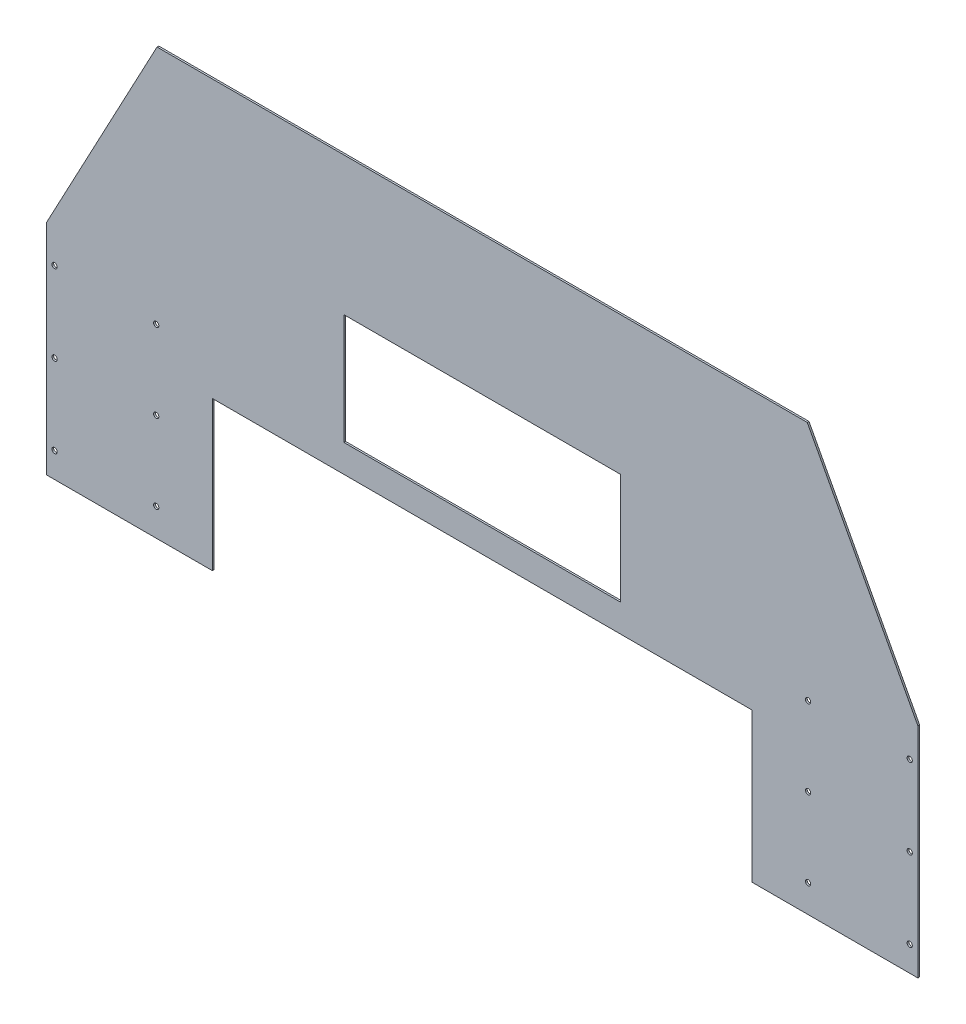
ISO-10303-21;
HEADER;
FILE_DESCRIPTION(('STEP AP214'),'2;1');
FILE_NAME('part.step','',(''),(''),'','','');
FILE_SCHEMA(('AUTOMOTIVE_DESIGN { 1 0 10303 214 1 1 1 1 }'));
ENDSEC;
DATA;
#1=APPLICATION_CONTEXT('core data for automotive mechanical design processes');
#2=APPLICATION_PROTOCOL_DEFINITION('international standard','automotive_design',2000,#1);
#3=PRODUCT_CONTEXT('',#1,'mechanical');
#4=PRODUCT('Part','Part','',(#3));
#5=PRODUCT_RELATED_PRODUCT_CATEGORY('part','',(#4));
#6=PRODUCT_DEFINITION_FORMATION('','',#4);
#7=PRODUCT_DEFINITION_CONTEXT('part definition',#1,'design');
#8=PRODUCT_DEFINITION('design','',#6,#7);
#9=PRODUCT_DEFINITION_SHAPE('','',#8);
#10=(LENGTH_UNIT() NAMED_UNIT(*) SI_UNIT(.MILLI.,.METRE.));
#11=(NAMED_UNIT(*) PLANE_ANGLE_UNIT() SI_UNIT($,.RADIAN.));
#12=(NAMED_UNIT(*) SI_UNIT($,.STERADIAN.) SOLID_ANGLE_UNIT());
#13=UNCERTAINTY_MEASURE_WITH_UNIT(LENGTH_MEASURE(1.E-05),#10,'distance_accuracy_value','');
#14=(GEOMETRIC_REPRESENTATION_CONTEXT(3) GLOBAL_UNCERTAINTY_ASSIGNED_CONTEXT((#13)) GLOBAL_UNIT_ASSIGNED_CONTEXT((#10,
#11,#12)) REPRESENTATION_CONTEXT('',''));
#15=CARTESIAN_POINT('',(0.,0.,0.));
#16=DIRECTION('',(0.,0.,1.));
#17=DIRECTION('',(1.,0.,0.));
#18=AXIS2_PLACEMENT_3D('',#15,#16,#17);
#19=CARTESIAN_POINT('',(-76.2,-100.203,-1.6002));
#20=DIRECTION('',(-1.,0.,0.));
#21=DIRECTION('',(0.,0.,1.));
#22=AXIS2_PLACEMENT_3D('',#19,#20,#21);
#23=PLANE('',#22);
#24=DIRECTION('',(0.,-1.,0.));
#25=VECTOR('',#24,1.);
#26=CARTESIAN_POINT('',(-76.2,-100.203,0.));
#27=LINE('',#26,#25);
#28=CARTESIAN_POINT('',(-76.2,100.203,0.));
#29=VERTEX_POINT('',#28);
#30=CARTESIAN_POINT('',(-76.2,-100.203,0.));
#31=VERTEX_POINT('',#30);
#32=EDGE_CURVE('E245',#29,#31,#27,.T.);
#33=ORIENTED_EDGE('',*,*,#32,.F.);
#34=DIRECTION('',(0.,0.,1.));
#35=VECTOR('',#34,1.);
#36=CARTESIAN_POINT('',(-76.2,100.203,-1.6002));
#37=LINE('',#36,#35);
#38=CARTESIAN_POINT('',(-76.2,100.203,-1.6002));
#39=VERTEX_POINT('',#38);
#40=EDGE_CURVE('E11',#39,#29,#37,.T.);
#41=ORIENTED_EDGE('',*,*,#40,.F.);
#42=DIRECTION('',(0.,-1.,0.));
#43=VECTOR('',#42,1.);
#44=CARTESIAN_POINT('',(-76.2,-100.203,-1.6002));
#45=LINE('',#44,#43);
#46=CARTESIAN_POINT('',(-76.2,-100.203,-1.6002));
#47=VERTEX_POINT('',#46);
#48=EDGE_CURVE('E248',#39,#47,#45,.T.);
#49=ORIENTED_EDGE('',*,*,#48,.T.);
#50=DIRECTION('',(0.,0.,1.));
#51=VECTOR('',#50,1.);
#52=CARTESIAN_POINT('',(-76.2,-100.203,-1.6002));
#53=LINE('',#52,#51);
#54=EDGE_CURVE('E41',#47,#31,#53,.T.);
#55=ORIENTED_EDGE('',*,*,#54,.T.);
#56=EDGE_LOOP('',(#33,#41,#49,#55));
#57=FACE_BOUND('',#56,.T.);
#58=ADVANCED_FACE('F38',(#57),#23,.T.);
#59=CARTESIAN_POINT('',(25.4000000000002,290.703,-1.6002));
#60=DIRECTION('',(-0.88235294117647,0.470588235294118,0.));
#61=DIRECTION('',(-0.470588235294118,-0.88235294117647,0.));
#62=AXIS2_PLACEMENT_3D('',#59,#60,#61);
#63=PLANE('',#62);
#64=DIRECTION('',(-0.470588235294118,-0.88235294117647,0.));
#65=VECTOR('',#64,1.);
#66=CARTESIAN_POINT('',(25.4000000000002,290.703,0.));
#67=LINE('',#66,#65);
#68=CARTESIAN_POINT('',(25.4000000000002,290.703,0.));
#69=VERTEX_POINT('',#68);
#70=EDGE_CURVE('E252',#69,#29,#67,.T.);
#71=ORIENTED_EDGE('',*,*,#70,.F.);
#72=DIRECTION('',(0.,0.,1.));
#73=VECTOR('',#72,1.);
#74=CARTESIAN_POINT('',(25.4000000000002,290.703,-1.6002));
#75=LINE('',#74,#73);
#76=CARTESIAN_POINT('',(25.4000000000002,290.703,-1.6002));
#77=VERTEX_POINT('',#76);
#78=EDGE_CURVE('E46',#77,#69,#75,.T.);
#79=ORIENTED_EDGE('',*,*,#78,.F.);
#80=DIRECTION('',(-0.470588235294118,-0.88235294117647,0.));
#81=VECTOR('',#80,1.);
#82=CARTESIAN_POINT('',(25.4000000000002,290.703,-1.6002));
#83=LINE('',#82,#81);
#84=EDGE_CURVE('E276',#77,#39,#83,.T.);
#85=ORIENTED_EDGE('',*,*,#84,.T.);
#86=ORIENTED_EDGE('',*,*,#40,.T.);
#87=EDGE_LOOP('',(#71,#79,#85,#86));
#88=FACE_BOUND('',#87,.T.);
#89=ADVANCED_FACE('F332',(#88),#63,.T.);
#90=CARTESIAN_POINT('',(622.3,290.703,-1.6002));
#91=DIRECTION('',(0.,1.,0.));
#92=DIRECTION('',(0.,0.,1.));
#93=AXIS2_PLACEMENT_3D('',#90,#91,#92);
#94=PLANE('',#93);
#95=DIRECTION('',(-1.,0.,0.));
#96=VECTOR('',#95,1.);
#97=CARTESIAN_POINT('',(622.3,290.703,0.));
#98=LINE('',#97,#96);
#99=CARTESIAN_POINT('',(622.3,290.703,0.));
#100=VERTEX_POINT('',#99);
#101=EDGE_CURVE('E302',#100,#69,#98,.T.);
#102=ORIENTED_EDGE('',*,*,#101,.F.);
#103=DIRECTION('',(0.,0.,1.));
#104=VECTOR('',#103,1.);
#105=CARTESIAN_POINT('',(622.3,290.703,-1.6002));
#106=LINE('',#105,#104);
#107=CARTESIAN_POINT('',(622.3,290.703,-1.6002));
#108=VERTEX_POINT('',#107);
#109=EDGE_CURVE('E308',#108,#100,#106,.T.);
#110=ORIENTED_EDGE('',*,*,#109,.F.);
#111=DIRECTION('',(-1.,0.,0.));
#112=VECTOR('',#111,1.);
#113=CARTESIAN_POINT('',(622.3,290.703,-1.6002));
#114=LINE('',#113,#112);
#115=EDGE_CURVE('E273',#108,#77,#114,.T.);
#116=ORIENTED_EDGE('',*,*,#115,.T.);
#117=ORIENTED_EDGE('',*,*,#78,.T.);
#118=EDGE_LOOP('',(#102,#110,#116,#117));
#119=FACE_BOUND('',#118,.T.);
#120=ADVANCED_FACE('F361',(#119),#94,.T.);
#121=CARTESIAN_POINT('',(723.9,100.203,-1.6002));
#122=DIRECTION('',(0.88235294117647,0.470588235294118,0.));
#123=DIRECTION('',(-0.470588235294118,0.88235294117647,0.));
#124=AXIS2_PLACEMENT_3D('',#121,#122,#123);
#125=PLANE('',#124);
#126=DIRECTION('',(-0.470588235294118,0.88235294117647,0.));
#127=VECTOR('',#126,1.);
#128=CARTESIAN_POINT('',(723.9,100.203,0.));
#129=LINE('',#128,#127);
#130=CARTESIAN_POINT('',(723.9,100.203,0.));
#131=VERTEX_POINT('',#130);
#132=EDGE_CURVE('E299',#131,#100,#129,.T.);
#133=ORIENTED_EDGE('',*,*,#132,.F.);
#134=DIRECTION('',(0.,0.,1.));
#135=VECTOR('',#134,1.);
#136=CARTESIAN_POINT('',(723.9,100.203,-1.6002));
#137=LINE('',#136,#135);
#138=CARTESIAN_POINT('',(723.9,100.203,-1.6002));
#139=VERTEX_POINT('',#138);
#140=EDGE_CURVE('E310',#139,#131,#137,.T.);
#141=ORIENTED_EDGE('',*,*,#140,.F.);
#142=DIRECTION('',(-0.470588235294118,0.88235294117647,0.));
#143=VECTOR('',#142,1.);
#144=CARTESIAN_POINT('',(723.9,100.203,-1.6002));
#145=LINE('',#144,#143);
#146=EDGE_CURVE('E270',#139,#108,#145,.T.);
#147=ORIENTED_EDGE('',*,*,#146,.T.);
#148=ORIENTED_EDGE('',*,*,#109,.T.);
#149=EDGE_LOOP('',(#133,#141,#147,#148));
#150=FACE_BOUND('',#149,.T.);
#151=ADVANCED_FACE('F359',(#150),#125,.T.);
#152=CARTESIAN_POINT('',(723.9,100.203,-1.6002));
#153=DIRECTION('',(1.,0.,0.));
#154=DIRECTION('',(0.,0.,-1.));
#155=AXIS2_PLACEMENT_3D('',#152,#153,#154);
#156=PLANE('',#155);
#157=DIRECTION('',(0.,1.,0.));
#158=VECTOR('',#157,1.);
#159=CARTESIAN_POINT('',(723.9,100.203,0.));
#160=LINE('',#159,#158);
#161=CARTESIAN_POINT('',(723.9,-100.203,0.));
#162=VERTEX_POINT('',#161);
#163=EDGE_CURVE('E296',#162,#131,#160,.T.);
#164=ORIENTED_EDGE('',*,*,#163,.F.);
#165=DIRECTION('',(0.,0.,1.));
#166=VECTOR('',#165,1.);
#167=CARTESIAN_POINT('',(723.9,-100.203,-1.6002));
#168=LINE('',#167,#166);
#169=CARTESIAN_POINT('',(723.9,-100.203,-1.6002));
#170=VERTEX_POINT('',#169);
#171=EDGE_CURVE('E312',#170,#162,#168,.T.);
#172=ORIENTED_EDGE('',*,*,#171,.F.);
#173=DIRECTION('',(0.,1.,0.));
#174=VECTOR('',#173,1.);
#175=CARTESIAN_POINT('',(723.9,100.203,-1.6002));
#176=LINE('',#175,#174);
#177=EDGE_CURVE('E267',#170,#139,#176,.T.);
#178=ORIENTED_EDGE('',*,*,#177,.T.);
#179=ORIENTED_EDGE('',*,*,#140,.T.);
#180=EDGE_LOOP('',(#164,#172,#178,#179));
#181=FACE_BOUND('',#180,.T.);
#182=ADVANCED_FACE('F355',(#181),#156,.T.);
#183=CARTESIAN_POINT('',(571.5,-100.203,-1.6002));
#184=DIRECTION('',(0.,-1.,0.));
#185=DIRECTION('',(0.,0.,-1.));
#186=AXIS2_PLACEMENT_3D('',#183,#184,#185);
#187=PLANE('',#186);
#188=DIRECTION('',(1.,0.,0.));
#189=VECTOR('',#188,1.);
#190=CARTESIAN_POINT('',(571.5,-100.203,0.));
#191=LINE('',#190,#189);
#192=CARTESIAN_POINT('',(571.5,-100.203,0.));
#193=VERTEX_POINT('',#192);
#194=EDGE_CURVE('E293',#193,#162,#191,.T.);
#195=ORIENTED_EDGE('',*,*,#194,.F.);
#196=DIRECTION('',(0.,0.,1.));
#197=VECTOR('',#196,1.);
#198=CARTESIAN_POINT('',(571.5,-100.203,-1.6002));
#199=LINE('',#198,#197);
#200=CARTESIAN_POINT('',(571.5,-100.203,-1.6002));
#201=VERTEX_POINT('',#200);
#202=EDGE_CURVE('E314',#201,#193,#199,.T.);
#203=ORIENTED_EDGE('',*,*,#202,.F.);
#204=DIRECTION('',(1.,0.,0.));
#205=VECTOR('',#204,1.);
#206=CARTESIAN_POINT('',(571.5,-100.203,-1.6002));
#207=LINE('',#206,#205);
#208=EDGE_CURVE('E264',#201,#170,#207,.T.);
#209=ORIENTED_EDGE('',*,*,#208,.T.);
#210=ORIENTED_EDGE('',*,*,#171,.T.);
#211=EDGE_LOOP('',(#195,#203,#209,#210));
#212=FACE_BOUND('',#211,.T.);
#213=ADVANCED_FACE('F351',(#212),#187,.T.);
#214=CARTESIAN_POINT('',(571.5,36.703,-1.6002));
#215=DIRECTION('',(-1.,0.,0.));
#216=DIRECTION('',(0.,0.,1.));
#217=AXIS2_PLACEMENT_3D('',#214,#215,#216);
#218=PLANE('',#217);
#219=DIRECTION('',(0.,-1.,0.));
#220=VECTOR('',#219,1.);
#221=CARTESIAN_POINT('',(571.5,36.703,0.));
#222=LINE('',#221,#220);
#223=CARTESIAN_POINT('',(571.5,36.703,0.));
#224=VERTEX_POINT('',#223);
#225=EDGE_CURVE('E290',#224,#193,#222,.T.);
#226=ORIENTED_EDGE('',*,*,#225,.F.);
#227=DIRECTION('',(0.,0.,1.));
#228=VECTOR('',#227,1.);
#229=CARTESIAN_POINT('',(571.5,36.703,-1.6002));
#230=LINE('',#229,#228);
#231=CARTESIAN_POINT('',(571.5,36.703,-1.6002));
#232=VERTEX_POINT('',#231);
#233=EDGE_CURVE('E316',#232,#224,#230,.T.);
#234=ORIENTED_EDGE('',*,*,#233,.F.);
#235=DIRECTION('',(0.,-1.,0.));
#236=VECTOR('',#235,1.);
#237=CARTESIAN_POINT('',(571.5,36.703,-1.6002));
#238=LINE('',#237,#236);
#239=EDGE_CURVE('E261',#232,#201,#238,.T.);
#240=ORIENTED_EDGE('',*,*,#239,.T.);
#241=ORIENTED_EDGE('',*,*,#202,.T.);
#242=EDGE_LOOP('',(#226,#234,#240,#241));
#243=FACE_BOUND('',#242,.T.);
#244=ADVANCED_FACE('F347',(#243),#218,.T.);
#245=CARTESIAN_POINT('',(76.2,36.703,-1.6002));
#246=DIRECTION('',(0.,-1.,0.));
#247=DIRECTION('',(0.,0.,-1.));
#248=AXIS2_PLACEMENT_3D('',#245,#246,#247);
#249=PLANE('',#248);
#250=DIRECTION('',(1.,0.,0.));
#251=VECTOR('',#250,1.);
#252=CARTESIAN_POINT('',(76.2,36.703,0.));
#253=LINE('',#252,#251);
#254=CARTESIAN_POINT('',(76.2,36.703,0.));
#255=VERTEX_POINT('',#254);
#256=EDGE_CURVE('E287',#255,#224,#253,.T.);
#257=ORIENTED_EDGE('',*,*,#256,.F.);
#258=DIRECTION('',(0.,0.,1.));
#259=VECTOR('',#258,1.);
#260=CARTESIAN_POINT('',(76.2,36.703,-1.6002));
#261=LINE('',#260,#259);
#262=CARTESIAN_POINT('',(76.2,36.703,-1.6002));
#263=VERTEX_POINT('',#262);
#264=EDGE_CURVE('E318',#263,#255,#261,.T.);
#265=ORIENTED_EDGE('',*,*,#264,.F.);
#266=DIRECTION('',(1.,0.,0.));
#267=VECTOR('',#266,1.);
#268=CARTESIAN_POINT('',(76.2,36.703,-1.6002));
#269=LINE('',#268,#267);
#270=EDGE_CURVE('E258',#263,#232,#269,.T.);
#271=ORIENTED_EDGE('',*,*,#270,.T.);
#272=ORIENTED_EDGE('',*,*,#233,.T.);
#273=EDGE_LOOP('',(#257,#265,#271,#272));
#274=FACE_BOUND('',#273,.T.);
#275=ADVANCED_FACE('F345',(#274),#249,.T.);
#276=CARTESIAN_POINT('',(76.2,-100.203,-1.6002));
#277=DIRECTION('',(1.,0.,0.));
#278=DIRECTION('',(0.,0.,-1.));
#279=AXIS2_PLACEMENT_3D('',#276,#277,#278);
#280=PLANE('',#279);
#281=DIRECTION('',(0.,1.,0.));
#282=VECTOR('',#281,1.);
#283=CARTESIAN_POINT('',(76.2,-100.203,0.));
#284=LINE('',#283,#282);
#285=CARTESIAN_POINT('',(76.2,-100.203,0.));
#286=VERTEX_POINT('',#285);
#287=EDGE_CURVE('E284',#286,#255,#284,.T.);
#288=ORIENTED_EDGE('',*,*,#287,.F.);
#289=DIRECTION('',(0.,0.,1.));
#290=VECTOR('',#289,1.);
#291=CARTESIAN_POINT('',(76.2,-100.203,-1.6002));
#292=LINE('',#291,#290);
#293=CARTESIAN_POINT('',(76.2,-100.203,-1.6002));
#294=VERTEX_POINT('',#293);
#295=EDGE_CURVE('E319',#294,#286,#292,.T.);
#296=ORIENTED_EDGE('',*,*,#295,.F.);
#297=DIRECTION('',(0.,1.,0.));
#298=VECTOR('',#297,1.);
#299=CARTESIAN_POINT('',(76.2,-100.203,-1.6002));
#300=LINE('',#299,#298);
#301=EDGE_CURVE('E255',#294,#263,#300,.T.);
#302=ORIENTED_EDGE('',*,*,#301,.T.);
#303=ORIENTED_EDGE('',*,*,#264,.T.);
#304=EDGE_LOOP('',(#288,#296,#302,#303));
#305=FACE_BOUND('',#304,.T.);
#306=ADVANCED_FACE('F341',(#305),#280,.T.);
#307=CARTESIAN_POINT('',(-76.2,-100.203,-1.6002));
#308=DIRECTION('',(0.,-1.,0.));
#309=DIRECTION('',(0.,0.,-1.));
#310=AXIS2_PLACEMENT_3D('',#307,#308,#309);
#311=PLANE('',#310);
#312=DIRECTION('',(1.,0.,0.));
#313=VECTOR('',#312,1.);
#314=CARTESIAN_POINT('',(-76.2,-100.203,0.));
#315=LINE('',#314,#313);
#316=EDGE_CURVE('E281',#31,#286,#315,.T.);
#317=ORIENTED_EDGE('',*,*,#316,.F.);
#318=ORIENTED_EDGE('',*,*,#54,.F.);
#319=DIRECTION('',(1.,0.,0.));
#320=VECTOR('',#319,1.);
#321=CARTESIAN_POINT('',(-76.2,-100.203,-1.6002));
#322=LINE('',#321,#320);
#323=EDGE_CURVE('E251',#47,#294,#322,.T.);
#324=ORIENTED_EDGE('',*,*,#323,.T.);
#325=ORIENTED_EDGE('',*,*,#295,.T.);
#326=EDGE_LOOP('',(#317,#318,#324,#325));
#327=FACE_BOUND('',#326,.T.);
#328=ADVANCED_FACE('F327',(#327),#311,.T.);
#329=CARTESIAN_POINT('',(0.,0.,-1.6002));
#330=DIRECTION('',(0.,0.,1.));
#331=DIRECTION('',(1.,0.,0.));
#332=AXIS2_PLACEMENT_3D('',#329,#330,#331);
#333=PLANE('',#332);
#334=DIRECTION('',(1.,0.,0.));
#335=VECTOR('',#334,1.);
#336=CARTESIAN_POINT('',(450.85,163.703,-1.6002));
#337=LINE('',#336,#335);
#338=CARTESIAN_POINT('',(196.85,163.703,-1.6002));
#339=VERTEX_POINT('',#338);
#340=CARTESIAN_POINT('',(450.85,163.703,-1.6002));
#341=VERTEX_POINT('',#340);
#342=EDGE_CURVE('E166',#339,#341,#337,.T.);
#343=ORIENTED_EDGE('',*,*,#342,.F.);
#344=DIRECTION('',(0.,1.,0.));
#345=VECTOR('',#344,1.);
#346=CARTESIAN_POINT('',(196.85,163.703,-1.6002));
#347=LINE('',#346,#345);
#348=CARTESIAN_POINT('',(196.85,62.103,-1.6002));
#349=VERTEX_POINT('',#348);
#350=EDGE_CURVE('E54',#349,#339,#347,.T.);
#351=ORIENTED_EDGE('',*,*,#350,.F.);
#352=DIRECTION('',(-1.,0.,0.));
#353=VECTOR('',#352,1.);
#354=CARTESIAN_POINT('',(450.85,62.103,-1.6002));
#355=LINE('',#354,#353);
#356=CARTESIAN_POINT('',(450.85,62.103,-1.6002));
#357=VERTEX_POINT('',#356);
#358=EDGE_CURVE('E157',#357,#349,#355,.T.);
#359=ORIENTED_EDGE('',*,*,#358,.F.);
#360=DIRECTION('',(0.,-1.,0.));
#361=VECTOR('',#360,1.);
#362=CARTESIAN_POINT('',(450.85,163.703,-1.6002));
#363=LINE('',#362,#361);
#364=EDGE_CURVE('E160',#341,#357,#363,.T.);
#365=ORIENTED_EDGE('',*,*,#364,.F.);
#366=EDGE_LOOP('',(#343,#351,#359,#365));
#367=FACE_BOUND('',#366,.T.);
#368=CARTESIAN_POINT('',(623.062000103998,-74.8029999999936,-1.6002));
#369=DIRECTION('',(0.,0.,-1.));
#370=DIRECTION('',(-1.,0.,0.));
#371=AXIS2_PLACEMENT_3D('',#368,#369,#370);
#372=CIRCLE('',#371,2.4129999999999);
#373=CARTESIAN_POINT('',(620.649000103998,-74.8029999999936,-1.6002));
#374=VERTEX_POINT('',#373);
#375=EDGE_CURVE('E176',#374,#374,#372,.T.);
#376=ORIENTED_EDGE('',*,*,#375,.F.);
#377=EDGE_LOOP('',(#376));
#378=FACE_BOUND('',#377,.T.);
#379=CARTESIAN_POINT('',(716.381599999996,-77.1397999999935,-1.6002));
#380=DIRECTION('',(0.,0.,-1.));
#381=DIRECTION('',(-1.,0.,0.));
#382=AXIS2_PLACEMENT_3D('',#379,#380,#381);
#383=CIRCLE('',#382,2.41299999999995);
#384=CARTESIAN_POINT('',(713.968599999995,-77.1397999999935,-1.6002));
#385=VERTEX_POINT('',#384);
#386=EDGE_CURVE('E182',#385,#385,#383,.T.);
#387=ORIENTED_EDGE('',*,*,#386,.F.);
#388=EDGE_LOOP('',(#387));
#389=FACE_BOUND('',#388,.T.);
#390=CARTESIAN_POINT('',(716.381599999995,-3.63219999999351,-1.6002));
#391=DIRECTION('',(0.,0.,-1.));
#392=DIRECTION('',(-1.,0.,0.));
#393=AXIS2_PLACEMENT_3D('',#390,#391,#392);
#394=CIRCLE('',#393,2.41299999999995);
#395=CARTESIAN_POINT('',(713.968599999995,-3.63219999999351,-1.6002));
#396=VERTEX_POINT('',#395);
#397=EDGE_CURVE('E188',#396,#396,#394,.T.);
#398=ORIENTED_EDGE('',*,*,#397,.F.);
#399=EDGE_LOOP('',(#398));
#400=FACE_BOUND('',#399,.T.);
#401=CARTESIAN_POINT('',(623.062000103998,-2.46379999999358,-1.6002));
#402=DIRECTION('',(0.,0.,-1.));
#403=DIRECTION('',(-1.,0.,0.));
#404=AXIS2_PLACEMENT_3D('',#401,#402,#403);
#405=CIRCLE('',#404,2.41299999999991);
#406=CARTESIAN_POINT('',(620.649000103998,-2.46379999999358,-1.6002));
#407=VERTEX_POINT('',#406);
#408=EDGE_CURVE('E194',#407,#407,#405,.T.);
#409=ORIENTED_EDGE('',*,*,#408,.F.);
#410=EDGE_LOOP('',(#409));
#411=FACE_BOUND('',#410,.T.);
#412=CARTESIAN_POINT('',(716.381599999995,69.8754000000065,-1.6002));
#413=DIRECTION('',(0.,0.,-1.));
#414=DIRECTION('',(-1.,0.,0.));
#415=AXIS2_PLACEMENT_3D('',#412,#413,#414);
#416=CIRCLE('',#415,2.41299999999995);
#417=CARTESIAN_POINT('',(713.968599999995,69.8754000000065,-1.6002));
#418=VERTEX_POINT('',#417);
#419=EDGE_CURVE('E200',#418,#418,#416,.T.);
#420=ORIENTED_EDGE('',*,*,#419,.F.);
#421=EDGE_LOOP('',(#420));
#422=FACE_BOUND('',#421,.T.);
#423=CARTESIAN_POINT('',(623.062000103998,69.8754000000064,-1.6002));
#424=DIRECTION('',(0.,0.,-1.));
#425=DIRECTION('',(-1.,0.,0.));
#426=AXIS2_PLACEMENT_3D('',#423,#424,#425);
#427=CIRCLE('',#426,2.41299999999991);
#428=CARTESIAN_POINT('',(620.649000103998,69.8754000000064,-1.6002));
#429=VERTEX_POINT('',#428);
#430=EDGE_CURVE('E206',#429,#429,#427,.T.);
#431=ORIENTED_EDGE('',*,*,#430,.F.);
#432=EDGE_LOOP('',(#431));
#433=FACE_BOUND('',#432,.T.);
#434=CARTESIAN_POINT('',(24.6379998960024,-74.8029999999936,-1.6002));
#435=DIRECTION('',(0.,0.,1.));
#436=DIRECTION('',(1.,0.,0.));
#437=AXIS2_PLACEMENT_3D('',#434,#435,#436);
#438=CIRCLE('',#437,2.4129999999999);
#439=CARTESIAN_POINT('',(27.0509998960023,-74.8029999999936,-1.6002));
#440=VERTEX_POINT('',#439);
#441=EDGE_CURVE('E212',#440,#440,#438,.T.);
#442=ORIENTED_EDGE('',*,*,#441,.T.);
#443=EDGE_LOOP('',(#442));
#444=FACE_BOUND('',#443,.T.);
#445=CARTESIAN_POINT('',(-68.6815999999955,-77.1397999999935,-1.6002));
#446=DIRECTION('',(0.,0.,1.));
#447=DIRECTION('',(1.,0.,0.));
#448=AXIS2_PLACEMENT_3D('',#445,#446,#447);
#449=CIRCLE('',#448,2.41299999999995);
#450=CARTESIAN_POINT('',(-66.2685999999955,-77.1397999999935,-1.6002));
#451=VERTEX_POINT('',#450);
#452=EDGE_CURVE('E218',#451,#451,#449,.T.);
#453=ORIENTED_EDGE('',*,*,#452,.T.);
#454=EDGE_LOOP('',(#453));
#455=FACE_BOUND('',#454,.T.);
#456=CARTESIAN_POINT('',(-68.6815999999952,-3.63219999999351,-1.6002));
#457=DIRECTION('',(0.,0.,1.));
#458=DIRECTION('',(1.,0.,0.));
#459=AXIS2_PLACEMENT_3D('',#456,#457,#458);
#460=CIRCLE('',#459,2.41299999999995);
#461=CARTESIAN_POINT('',(-66.2685999999952,-3.63219999999351,-1.6002));
#462=VERTEX_POINT('',#461);
#463=EDGE_CURVE('E224',#462,#462,#460,.T.);
#464=ORIENTED_EDGE('',*,*,#463,.T.);
#465=EDGE_LOOP('',(#464));
#466=FACE_BOUND('',#465,.T.);
#467=CARTESIAN_POINT('',(24.6379998960021,-2.46379999999358,-1.6002));
#468=DIRECTION('',(0.,0.,1.));
#469=DIRECTION('',(1.,0.,0.));
#470=AXIS2_PLACEMENT_3D('',#467,#468,#469);
#471=CIRCLE('',#470,2.41299999999991);
#472=CARTESIAN_POINT('',(27.050999896002,-2.46379999999358,-1.6002));
#473=VERTEX_POINT('',#472);
#474=EDGE_CURVE('E230',#473,#473,#471,.T.);
#475=ORIENTED_EDGE('',*,*,#474,.T.);
#476=EDGE_LOOP('',(#475));
#477=FACE_BOUND('',#476,.T.);
#478=CARTESIAN_POINT('',(-68.6815999999949,69.8754000000065,-1.6002));
#479=DIRECTION('',(0.,0.,1.));
#480=DIRECTION('',(1.,0.,0.));
#481=AXIS2_PLACEMENT_3D('',#478,#479,#480);
#482=CIRCLE('',#481,2.41299999999995);
#483=CARTESIAN_POINT('',(-66.268599999995,69.8754000000065,-1.6002));
#484=VERTEX_POINT('',#483);
#485=EDGE_CURVE('E236',#484,#484,#482,.T.);
#486=ORIENTED_EDGE('',*,*,#485,.T.);
#487=EDGE_LOOP('',(#486));
#488=FACE_BOUND('',#487,.T.);
#489=CARTESIAN_POINT('',(24.6379998960018,69.8754000000064,-1.6002));
#490=DIRECTION('',(0.,0.,1.));
#491=DIRECTION('',(1.,0.,0.));
#492=AXIS2_PLACEMENT_3D('',#489,#490,#491);
#493=CIRCLE('',#492,2.41299999999991);
#494=CARTESIAN_POINT('',(27.0509998960017,69.8754000000064,-1.6002));
#495=VERTEX_POINT('',#494);
#496=EDGE_CURVE('E242',#495,#495,#493,.T.);
#497=ORIENTED_EDGE('',*,*,#496,.T.);
#498=EDGE_LOOP('',(#497));
#499=FACE_BOUND('',#498,.T.);
#500=ORIENTED_EDGE('',*,*,#48,.F.);
#501=ORIENTED_EDGE('',*,*,#84,.F.);
#502=ORIENTED_EDGE('',*,*,#115,.F.);
#503=ORIENTED_EDGE('',*,*,#146,.F.);
#504=ORIENTED_EDGE('',*,*,#177,.F.);
#505=ORIENTED_EDGE('',*,*,#208,.F.);
#506=ORIENTED_EDGE('',*,*,#239,.F.);
#507=ORIENTED_EDGE('',*,*,#270,.F.);
#508=ORIENTED_EDGE('',*,*,#301,.F.);
#509=ORIENTED_EDGE('',*,*,#323,.F.);
#510=EDGE_LOOP('',(#500,#501,#502,#503,#504,#505,#506,#507,#508,#509));
#511=FACE_BOUND('',#510,.T.);
#512=ADVANCED_FACE('F335',(#367,#378,#389,#400,#411,#422,#433,#444,#455,#466,#477,#488,#499,
#511),#333,.F.);
#513=CARTESIAN_POINT('',(0.,0.,0.));
#514=DIRECTION('',(0.,0.,1.));
#515=DIRECTION('',(1.,0.,0.));
#516=AXIS2_PLACEMENT_3D('',#513,#514,#515);
#517=PLANE('',#516);
#518=DIRECTION('',(0.,1.,0.));
#519=VECTOR('',#518,1.);
#520=CARTESIAN_POINT('',(196.85,163.703,0.));
#521=LINE('',#520,#519);
#522=CARTESIAN_POINT('',(196.85,62.103,0.));
#523=VERTEX_POINT('',#522);
#524=CARTESIAN_POINT('',(196.85,163.703,0.));
#525=VERTEX_POINT('',#524);
#526=EDGE_CURVE('E141',#523,#525,#521,.T.);
#527=ORIENTED_EDGE('',*,*,#526,.T.);
#528=DIRECTION('',(1.,0.,0.));
#529=VECTOR('',#528,1.);
#530=CARTESIAN_POINT('',(450.85,163.703,0.));
#531=LINE('',#530,#529);
#532=CARTESIAN_POINT('',(450.85,163.703,0.));
#533=VERTEX_POINT('',#532);
#534=EDGE_CURVE('E150',#525,#533,#531,.T.);
#535=ORIENTED_EDGE('',*,*,#534,.T.);
#536=DIRECTION('',(0.,-1.,0.));
#537=VECTOR('',#536,1.);
#538=CARTESIAN_POINT('',(450.85,163.703,0.));
#539=LINE('',#538,#537);
#540=CARTESIAN_POINT('',(450.85,62.103,0.));
#541=VERTEX_POINT('',#540);
#542=EDGE_CURVE('E62',#533,#541,#539,.T.);
#543=ORIENTED_EDGE('',*,*,#542,.T.);
#544=DIRECTION('',(-1.,0.,0.));
#545=VECTOR('',#544,1.);
#546=CARTESIAN_POINT('',(450.85,62.103,0.));
#547=LINE('',#546,#545);
#548=EDGE_CURVE('E147',#541,#523,#547,.T.);
#549=ORIENTED_EDGE('',*,*,#548,.T.);
#550=EDGE_LOOP('',(#527,#535,#543,#549));
#551=FACE_BOUND('',#550,.T.);
#552=CARTESIAN_POINT('',(623.062000103998,-74.8029999999936,0.));
#553=DIRECTION('',(0.,0.,-1.));
#554=DIRECTION('',(-1.,0.,0.));
#555=AXIS2_PLACEMENT_3D('',#552,#553,#554);
#556=CIRCLE('',#555,2.4129999999999);
#557=CARTESIAN_POINT('',(620.649000103998,-74.8029999999936,0.));
#558=VERTEX_POINT('',#557);
#559=EDGE_CURVE('E172',#558,#558,#556,.T.);
#560=ORIENTED_EDGE('',*,*,#559,.T.);
#561=EDGE_LOOP('',(#560));
#562=FACE_BOUND('',#561,.T.);
#563=CARTESIAN_POINT('',(716.381599999996,-77.1397999999935,0.));
#564=DIRECTION('',(0.,0.,-1.));
#565=DIRECTION('',(-1.,0.,0.));
#566=AXIS2_PLACEMENT_3D('',#563,#564,#565);
#567=CIRCLE('',#566,2.41299999999995);
#568=CARTESIAN_POINT('',(713.968599999995,-77.1397999999935,0.));
#569=VERTEX_POINT('',#568);
#570=EDGE_CURVE('E179',#569,#569,#567,.T.);
#571=ORIENTED_EDGE('',*,*,#570,.T.);
#572=EDGE_LOOP('',(#571));
#573=FACE_BOUND('',#572,.T.);
#574=CARTESIAN_POINT('',(716.381599999995,-3.63219999999351,0.));
#575=DIRECTION('',(0.,0.,-1.));
#576=DIRECTION('',(-1.,0.,0.));
#577=AXIS2_PLACEMENT_3D('',#574,#575,#576);
#578=CIRCLE('',#577,2.41299999999995);
#579=CARTESIAN_POINT('',(713.968599999995,-3.63219999999351,0.));
#580=VERTEX_POINT('',#579);
#581=EDGE_CURVE('E185',#580,#580,#578,.T.);
#582=ORIENTED_EDGE('',*,*,#581,.T.);
#583=EDGE_LOOP('',(#582));
#584=FACE_BOUND('',#583,.T.);
#585=CARTESIAN_POINT('',(623.062000103998,-2.46379999999358,0.));
#586=DIRECTION('',(0.,0.,-1.));
#587=DIRECTION('',(-1.,0.,0.));
#588=AXIS2_PLACEMENT_3D('',#585,#586,#587);
#589=CIRCLE('',#588,2.41299999999991);
#590=CARTESIAN_POINT('',(620.649000103998,-2.46379999999358,0.));
#591=VERTEX_POINT('',#590);
#592=EDGE_CURVE('E191',#591,#591,#589,.T.);
#593=ORIENTED_EDGE('',*,*,#592,.T.);
#594=EDGE_LOOP('',(#593));
#595=FACE_BOUND('',#594,.T.);
#596=CARTESIAN_POINT('',(716.381599999995,69.8754000000065,0.));
#597=DIRECTION('',(0.,0.,-1.));
#598=DIRECTION('',(-1.,0.,0.));
#599=AXIS2_PLACEMENT_3D('',#596,#597,#598);
#600=CIRCLE('',#599,2.41299999999995);
#601=CARTESIAN_POINT('',(713.968599999995,69.8754000000065,0.));
#602=VERTEX_POINT('',#601);
#603=EDGE_CURVE('E197',#602,#602,#600,.T.);
#604=ORIENTED_EDGE('',*,*,#603,.T.);
#605=EDGE_LOOP('',(#604));
#606=FACE_BOUND('',#605,.T.);
#607=CARTESIAN_POINT('',(623.062000103998,69.8754000000064,0.));
#608=DIRECTION('',(0.,0.,-1.));
#609=DIRECTION('',(-1.,0.,0.));
#610=AXIS2_PLACEMENT_3D('',#607,#608,#609);
#611=CIRCLE('',#610,2.41299999999991);
#612=CARTESIAN_POINT('',(620.649000103998,69.8754000000064,0.));
#613=VERTEX_POINT('',#612);
#614=EDGE_CURVE('E203',#613,#613,#611,.T.);
#615=ORIENTED_EDGE('',*,*,#614,.T.);
#616=EDGE_LOOP('',(#615));
#617=FACE_BOUND('',#616,.T.);
#618=CARTESIAN_POINT('',(24.6379998960024,-74.8029999999936,0.));
#619=DIRECTION('',(0.,0.,1.));
#620=DIRECTION('',(1.,0.,0.));
#621=AXIS2_PLACEMENT_3D('',#618,#619,#620);
#622=CIRCLE('',#621,2.4129999999999);
#623=CARTESIAN_POINT('',(27.0509998960023,-74.8029999999936,0.));
#624=VERTEX_POINT('',#623);
#625=EDGE_CURVE('E209',#624,#624,#622,.T.);
#626=ORIENTED_EDGE('',*,*,#625,.F.);
#627=EDGE_LOOP('',(#626));
#628=FACE_BOUND('',#627,.T.);
#629=CARTESIAN_POINT('',(-68.6815999999955,-77.1397999999935,0.));
#630=DIRECTION('',(0.,0.,1.));
#631=DIRECTION('',(1.,0.,0.));
#632=AXIS2_PLACEMENT_3D('',#629,#630,#631);
#633=CIRCLE('',#632,2.41299999999995);
#634=CARTESIAN_POINT('',(-66.2685999999955,-77.1397999999935,0.));
#635=VERTEX_POINT('',#634);
#636=EDGE_CURVE('E215',#635,#635,#633,.T.);
#637=ORIENTED_EDGE('',*,*,#636,.F.);
#638=EDGE_LOOP('',(#637));
#639=FACE_BOUND('',#638,.T.);
#640=CARTESIAN_POINT('',(-68.6815999999952,-3.63219999999351,0.));
#641=DIRECTION('',(0.,0.,1.));
#642=DIRECTION('',(1.,0.,0.));
#643=AXIS2_PLACEMENT_3D('',#640,#641,#642);
#644=CIRCLE('',#643,2.41299999999995);
#645=CARTESIAN_POINT('',(-66.2685999999952,-3.63219999999351,0.));
#646=VERTEX_POINT('',#645);
#647=EDGE_CURVE('E221',#646,#646,#644,.T.);
#648=ORIENTED_EDGE('',*,*,#647,.F.);
#649=EDGE_LOOP('',(#648));
#650=FACE_BOUND('',#649,.T.);
#651=CARTESIAN_POINT('',(24.6379998960021,-2.46379999999358,0.));
#652=DIRECTION('',(0.,0.,1.));
#653=DIRECTION('',(1.,0.,0.));
#654=AXIS2_PLACEMENT_3D('',#651,#652,#653);
#655=CIRCLE('',#654,2.41299999999991);
#656=CARTESIAN_POINT('',(27.050999896002,-2.46379999999358,0.));
#657=VERTEX_POINT('',#656);
#658=EDGE_CURVE('E227',#657,#657,#655,.T.);
#659=ORIENTED_EDGE('',*,*,#658,.F.);
#660=EDGE_LOOP('',(#659));
#661=FACE_BOUND('',#660,.T.);
#662=CARTESIAN_POINT('',(-68.6815999999949,69.8754000000065,0.));
#663=DIRECTION('',(0.,0.,1.));
#664=DIRECTION('',(1.,0.,0.));
#665=AXIS2_PLACEMENT_3D('',#662,#663,#664);
#666=CIRCLE('',#665,2.41299999999995);
#667=CARTESIAN_POINT('',(-66.268599999995,69.8754000000065,0.));
#668=VERTEX_POINT('',#667);
#669=EDGE_CURVE('E233',#668,#668,#666,.T.);
#670=ORIENTED_EDGE('',*,*,#669,.F.);
#671=EDGE_LOOP('',(#670));
#672=FACE_BOUND('',#671,.T.);
#673=CARTESIAN_POINT('',(24.6379998960018,69.8754000000064,0.));
#674=DIRECTION('',(0.,0.,1.));
#675=DIRECTION('',(1.,0.,0.));
#676=AXIS2_PLACEMENT_3D('',#673,#674,#675);
#677=CIRCLE('',#676,2.41299999999991);
#678=CARTESIAN_POINT('',(27.0509998960017,69.8754000000064,0.));
#679=VERTEX_POINT('',#678);
#680=EDGE_CURVE('E239',#679,#679,#677,.T.);
#681=ORIENTED_EDGE('',*,*,#680,.F.);
#682=EDGE_LOOP('',(#681));
#683=FACE_BOUND('',#682,.T.);
#684=ORIENTED_EDGE('',*,*,#32,.T.);
#685=ORIENTED_EDGE('',*,*,#316,.T.);
#686=ORIENTED_EDGE('',*,*,#287,.T.);
#687=ORIENTED_EDGE('',*,*,#256,.T.);
#688=ORIENTED_EDGE('',*,*,#225,.T.);
#689=ORIENTED_EDGE('',*,*,#194,.T.);
#690=ORIENTED_EDGE('',*,*,#163,.T.);
#691=ORIENTED_EDGE('',*,*,#132,.T.);
#692=ORIENTED_EDGE('',*,*,#101,.T.);
#693=ORIENTED_EDGE('',*,*,#70,.T.);
#694=EDGE_LOOP('',(#684,#685,#686,#687,#688,#689,#690,#691,#692,#693));
#695=FACE_BOUND('',#694,.T.);
#696=ADVANCED_FACE('F154',(#551,#562,#573,#584,#595,#606,#617,#628,#639,#650,#661,#672,#683,
#695),#517,.T.);
#697=CARTESIAN_POINT('',(24.6379998960018,69.8754000000064,-1.6002));
#698=DIRECTION('',(0.,0.,1.));
#699=DIRECTION('',(1.,0.,0.));
#700=AXIS2_PLACEMENT_3D('',#697,#698,#699);
#701=CYLINDRICAL_SURFACE('',#700,2.41299999999991);
#702=ORIENTED_EDGE('',*,*,#496,.F.);
#703=EDGE_LOOP('',(#702));
#704=FACE_BOUND('',#703,.T.);
#705=ORIENTED_EDGE('',*,*,#680,.T.);
#706=EDGE_LOOP('',(#705));
#707=FACE_BOUND('',#706,.T.);
#708=ADVANCED_FACE('F450',(#704,#707),#701,.F.);
#709=CARTESIAN_POINT('',(-68.6815999999949,69.8754000000065,-1.6002));
#710=DIRECTION('',(0.,0.,1.));
#711=DIRECTION('',(1.,0.,0.));
#712=AXIS2_PLACEMENT_3D('',#709,#710,#711);
#713=CYLINDRICAL_SURFACE('',#712,2.41299999999995);
#714=ORIENTED_EDGE('',*,*,#485,.F.);
#715=EDGE_LOOP('',(#714));
#716=FACE_BOUND('',#715,.T.);
#717=ORIENTED_EDGE('',*,*,#669,.T.);
#718=EDGE_LOOP('',(#717));
#719=FACE_BOUND('',#718,.T.);
#720=ADVANCED_FACE('F455',(#716,#719),#713,.F.);
#721=CARTESIAN_POINT('',(24.6379998960021,-2.46379999999358,-1.6002));
#722=DIRECTION('',(0.,0.,1.));
#723=DIRECTION('',(1.,0.,0.));
#724=AXIS2_PLACEMENT_3D('',#721,#722,#723);
#725=CYLINDRICAL_SURFACE('',#724,2.41299999999991);
#726=ORIENTED_EDGE('',*,*,#474,.F.);
#727=EDGE_LOOP('',(#726));
#728=FACE_BOUND('',#727,.T.);
#729=ORIENTED_EDGE('',*,*,#658,.T.);
#730=EDGE_LOOP('',(#729));
#731=FACE_BOUND('',#730,.T.);
#732=ADVANCED_FACE('F468',(#728,#731),#725,.F.);
#733=CARTESIAN_POINT('',(-68.6815999999952,-3.63219999999351,-1.6002));
#734=DIRECTION('',(0.,0.,1.));
#735=DIRECTION('',(1.,0.,0.));
#736=AXIS2_PLACEMENT_3D('',#733,#734,#735);
#737=CYLINDRICAL_SURFACE('',#736,2.41299999999995);
#738=ORIENTED_EDGE('',*,*,#463,.F.);
#739=EDGE_LOOP('',(#738));
#740=FACE_BOUND('',#739,.T.);
#741=ORIENTED_EDGE('',*,*,#647,.T.);
#742=EDGE_LOOP('',(#741));
#743=FACE_BOUND('',#742,.T.);
#744=ADVANCED_FACE('F479',(#740,#743),#737,.F.);
#745=CARTESIAN_POINT('',(-68.6815999999955,-77.1397999999935,-1.6002));
#746=DIRECTION('',(0.,0.,1.));
#747=DIRECTION('',(1.,0.,0.));
#748=AXIS2_PLACEMENT_3D('',#745,#746,#747);
#749=CYLINDRICAL_SURFACE('',#748,2.41299999999995);
#750=ORIENTED_EDGE('',*,*,#452,.F.);
#751=EDGE_LOOP('',(#750));
#752=FACE_BOUND('',#751,.T.);
#753=ORIENTED_EDGE('',*,*,#636,.T.);
#754=EDGE_LOOP('',(#753));
#755=FACE_BOUND('',#754,.T.);
#756=ADVANCED_FACE('F490',(#752,#755),#749,.F.);
#757=CARTESIAN_POINT('',(24.6379998960024,-74.8029999999936,-1.6002));
#758=DIRECTION('',(0.,0.,1.));
#759=DIRECTION('',(1.,0.,0.));
#760=AXIS2_PLACEMENT_3D('',#757,#758,#759);
#761=CYLINDRICAL_SURFACE('',#760,2.4129999999999);
#762=ORIENTED_EDGE('',*,*,#441,.F.);
#763=EDGE_LOOP('',(#762));
#764=FACE_BOUND('',#763,.T.);
#765=ORIENTED_EDGE('',*,*,#625,.T.);
#766=EDGE_LOOP('',(#765));
#767=FACE_BOUND('',#766,.T.);
#768=ADVANCED_FACE('F501',(#764,#767),#761,.F.);
#769=CARTESIAN_POINT('',(623.062000103998,69.8754000000064,-1.6002));
#770=DIRECTION('',(0.,0.,1.));
#771=DIRECTION('',(1.,0.,0.));
#772=AXIS2_PLACEMENT_3D('',#769,#770,#771);
#773=CYLINDRICAL_SURFACE('',#772,2.41299999999991);
#774=ORIENTED_EDGE('',*,*,#430,.T.);
#775=EDGE_LOOP('',(#774));
#776=FACE_BOUND('',#775,.T.);
#777=ORIENTED_EDGE('',*,*,#614,.F.);
#778=EDGE_LOOP('',(#777));
#779=FACE_BOUND('',#778,.T.);
#780=ADVANCED_FACE('F512',(#776,#779),#773,.F.);
#781=CARTESIAN_POINT('',(716.381599999995,69.8754000000065,-1.6002));
#782=DIRECTION('',(0.,0.,1.));
#783=DIRECTION('',(1.,0.,0.));
#784=AXIS2_PLACEMENT_3D('',#781,#782,#783);
#785=CYLINDRICAL_SURFACE('',#784,2.41299999999995);
#786=ORIENTED_EDGE('',*,*,#419,.T.);
#787=EDGE_LOOP('',(#786));
#788=FACE_BOUND('',#787,.T.);
#789=ORIENTED_EDGE('',*,*,#603,.F.);
#790=EDGE_LOOP('',(#789));
#791=FACE_BOUND('',#790,.T.);
#792=ADVANCED_FACE('F523',(#788,#791),#785,.F.);
#793=CARTESIAN_POINT('',(623.062000103998,-2.46379999999358,-1.6002));
#794=DIRECTION('',(0.,0.,1.));
#795=DIRECTION('',(1.,0.,0.));
#796=AXIS2_PLACEMENT_3D('',#793,#794,#795);
#797=CYLINDRICAL_SURFACE('',#796,2.41299999999991);
#798=ORIENTED_EDGE('',*,*,#408,.T.);
#799=EDGE_LOOP('',(#798));
#800=FACE_BOUND('',#799,.T.);
#801=ORIENTED_EDGE('',*,*,#592,.F.);
#802=EDGE_LOOP('',(#801));
#803=FACE_BOUND('',#802,.T.);
#804=ADVANCED_FACE('F534',(#800,#803),#797,.F.);
#805=CARTESIAN_POINT('',(716.381599999995,-3.63219999999351,-1.6002));
#806=DIRECTION('',(0.,0.,1.));
#807=DIRECTION('',(1.,0.,0.));
#808=AXIS2_PLACEMENT_3D('',#805,#806,#807);
#809=CYLINDRICAL_SURFACE('',#808,2.41299999999995);
#810=ORIENTED_EDGE('',*,*,#397,.T.);
#811=EDGE_LOOP('',(#810));
#812=FACE_BOUND('',#811,.T.);
#813=ORIENTED_EDGE('',*,*,#581,.F.);
#814=EDGE_LOOP('',(#813));
#815=FACE_BOUND('',#814,.T.);
#816=ADVANCED_FACE('F545',(#812,#815),#809,.F.);
#817=CARTESIAN_POINT('',(716.381599999996,-77.1397999999935,-1.6002));
#818=DIRECTION('',(0.,0.,1.));
#819=DIRECTION('',(1.,0.,0.));
#820=AXIS2_PLACEMENT_3D('',#817,#818,#819);
#821=CYLINDRICAL_SURFACE('',#820,2.41299999999995);
#822=ORIENTED_EDGE('',*,*,#386,.T.);
#823=EDGE_LOOP('',(#822));
#824=FACE_BOUND('',#823,.T.);
#825=ORIENTED_EDGE('',*,*,#570,.F.);
#826=EDGE_LOOP('',(#825));
#827=FACE_BOUND('',#826,.T.);
#828=ADVANCED_FACE('F556',(#824,#827),#821,.F.);
#829=CARTESIAN_POINT('',(623.062000103998,-74.8029999999936,-1.6002));
#830=DIRECTION('',(0.,0.,1.));
#831=DIRECTION('',(1.,0.,0.));
#832=AXIS2_PLACEMENT_3D('',#829,#830,#831);
#833=CYLINDRICAL_SURFACE('',#832,2.4129999999999);
#834=ORIENTED_EDGE('',*,*,#375,.T.);
#835=EDGE_LOOP('',(#834));
#836=FACE_BOUND('',#835,.T.);
#837=ORIENTED_EDGE('',*,*,#559,.F.);
#838=EDGE_LOOP('',(#837));
#839=FACE_BOUND('',#838,.T.);
#840=ADVANCED_FACE('F567',(#836,#839),#833,.F.);
#841=CARTESIAN_POINT('',(196.85,163.703,0.));
#842=DIRECTION('',(-1.,0.,0.));
#843=DIRECTION('',(0.,-1.,0.));
#844=AXIS2_PLACEMENT_3D('',#841,#842,#843);
#845=PLANE('',#844);
#846=ORIENTED_EDGE('',*,*,#350,.T.);
#847=DIRECTION('',(0.,0.,-1.));
#848=VECTOR('',#847,1.);
#849=CARTESIAN_POINT('',(196.85,163.703,0.));
#850=LINE('',#849,#848);
#851=EDGE_CURVE('E137',#525,#339,#850,.T.);
#852=ORIENTED_EDGE('',*,*,#851,.F.);
#853=ORIENTED_EDGE('',*,*,#526,.F.);
#854=DIRECTION('',(0.,0.,-1.));
#855=VECTOR('',#854,1.);
#856=CARTESIAN_POINT('',(196.85,62.103,0.));
#857=LINE('',#856,#855);
#858=EDGE_CURVE('E170',#523,#349,#857,.T.);
#859=ORIENTED_EDGE('',*,*,#858,.T.);
#860=EDGE_LOOP('',(#846,#852,#853,#859));
#861=FACE_BOUND('',#860,.T.);
#862=ADVANCED_FACE('F139',(#861),#845,.F.);
#863=CARTESIAN_POINT('',(450.85,62.103,0.));
#864=DIRECTION('',(0.,-1.,0.));
#865=DIRECTION('',(0.,0.,-1.));
#866=AXIS2_PLACEMENT_3D('',#863,#864,#865);
#867=PLANE('',#866);
#868=ORIENTED_EDGE('',*,*,#358,.T.);
#869=ORIENTED_EDGE('',*,*,#858,.F.);
#870=ORIENTED_EDGE('',*,*,#548,.F.);
#871=DIRECTION('',(0.,0.,-1.));
#872=VECTOR('',#871,1.);
#873=CARTESIAN_POINT('',(450.85,62.103,0.));
#874=LINE('',#873,#872);
#875=EDGE_CURVE('E173',#541,#357,#874,.T.);
#876=ORIENTED_EDGE('',*,*,#875,.T.);
#877=EDGE_LOOP('',(#868,#869,#870,#876));
#878=FACE_BOUND('',#877,.T.);
#879=ADVANCED_FACE('F603',(#878),#867,.F.);
#880=CARTESIAN_POINT('',(450.85,163.703,0.));
#881=DIRECTION('',(1.,0.,0.));
#882=DIRECTION('',(0.,1.,0.));
#883=AXIS2_PLACEMENT_3D('',#880,#881,#882);
#884=PLANE('',#883);
#885=ORIENTED_EDGE('',*,*,#364,.T.);
#886=ORIENTED_EDGE('',*,*,#875,.F.);
#887=ORIENTED_EDGE('',*,*,#542,.F.);
#888=DIRECTION('',(0.,0.,-1.));
#889=VECTOR('',#888,1.);
#890=CARTESIAN_POINT('',(450.85,163.703,0.));
#891=LINE('',#890,#889);
#892=EDGE_CURVE('E146',#533,#341,#891,.T.);
#893=ORIENTED_EDGE('',*,*,#892,.T.);
#894=EDGE_LOOP('',(#885,#886,#887,#893));
#895=FACE_BOUND('',#894,.T.);
#896=ADVANCED_FACE('F613',(#895),#884,.F.);
#897=CARTESIAN_POINT('',(450.85,163.703,0.));
#898=DIRECTION('',(0.,1.,0.));
#899=DIRECTION('',(0.,0.,1.));
#900=AXIS2_PLACEMENT_3D('',#897,#898,#899);
#901=PLANE('',#900);
#902=ORIENTED_EDGE('',*,*,#342,.T.);
#903=ORIENTED_EDGE('',*,*,#892,.F.);
#904=ORIENTED_EDGE('',*,*,#534,.F.);
#905=ORIENTED_EDGE('',*,*,#851,.T.);
#906=EDGE_LOOP('',(#902,#903,#904,#905));
#907=FACE_BOUND('',#906,.T.);
#908=ADVANCED_FACE('F151',(#907),#901,.F.);
#909=CLOSED_SHELL('',(#58,#89,#120,#151,#182,#213,#244,#275,#306,#328,#512,#696,#708,#720,#732,
#744,#756,#768,#780,#792,#804,#816,#828,#840,#862,#879,#896,#908));
#910=MANIFOLD_SOLID_BREP('B2',#909);
#911=ADVANCED_BREP_SHAPE_REPRESENTATION('',(#18,#910),#14);
#912=SHAPE_DEFINITION_REPRESENTATION(#9,#911);
ENDSEC;
END-ISO-10303-21;
